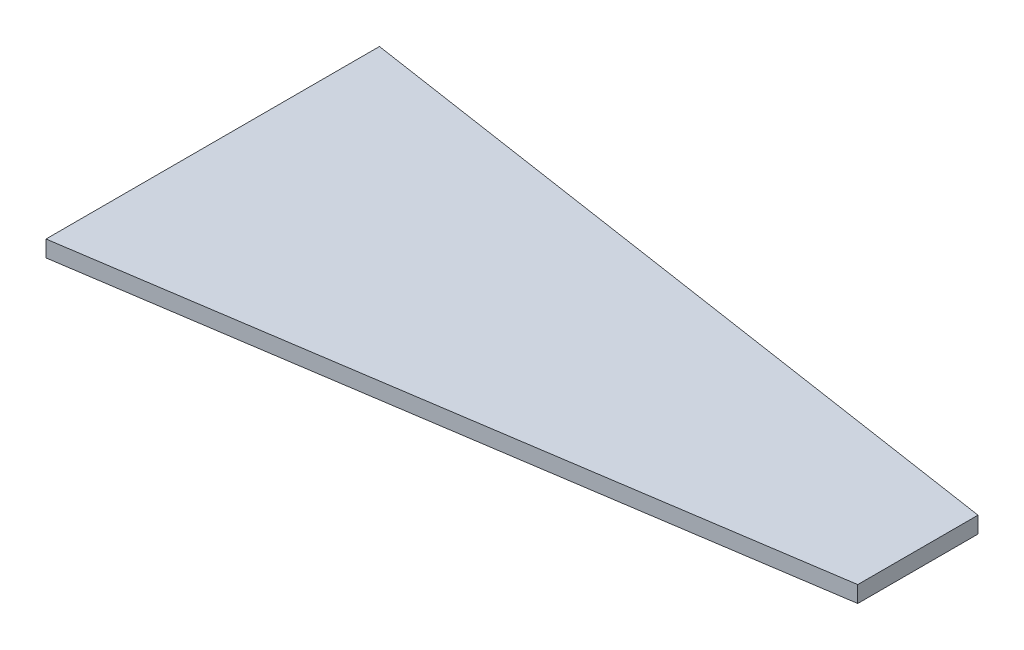
ISO-10303-21;
HEADER;
FILE_DESCRIPTION(('STEP AP214'),'2;1');
FILE_NAME('part.step','',(''),(''),'','','');
FILE_SCHEMA(('AUTOMOTIVE_DESIGN { 1 0 10303 214 1 1 1 1 }'));
ENDSEC;
DATA;
#1=APPLICATION_CONTEXT('core data for automotive mechanical design processes');
#2=APPLICATION_PROTOCOL_DEFINITION('international standard','automotive_design',2000,#1);
#3=PRODUCT_CONTEXT('',#1,'mechanical');
#4=PRODUCT('Part','Part','',(#3));
#5=PRODUCT_RELATED_PRODUCT_CATEGORY('part','',(#4));
#6=PRODUCT_DEFINITION_FORMATION('','',#4);
#7=PRODUCT_DEFINITION_CONTEXT('part definition',#1,'design');
#8=PRODUCT_DEFINITION('design','',#6,#7);
#9=PRODUCT_DEFINITION_SHAPE('','',#8);
#10=(LENGTH_UNIT() NAMED_UNIT(*) SI_UNIT(.MILLI.,.METRE.));
#11=(NAMED_UNIT(*) PLANE_ANGLE_UNIT() SI_UNIT($,.RADIAN.));
#12=(NAMED_UNIT(*) SI_UNIT($,.STERADIAN.) SOLID_ANGLE_UNIT());
#13=UNCERTAINTY_MEASURE_WITH_UNIT(LENGTH_MEASURE(1.E-05),#10,'distance_accuracy_value','');
#14=(GEOMETRIC_REPRESENTATION_CONTEXT(3) GLOBAL_UNCERTAINTY_ASSIGNED_CONTEXT((#13)) GLOBAL_UNIT_ASSIGNED_CONTEXT((#10,
#11,#12)) REPRESENTATION_CONTEXT('',''));
#15=CARTESIAN_POINT('',(0.,0.,0.));
#16=DIRECTION('',(0.,0.,1.));
#17=DIRECTION('',(1.,0.,0.));
#18=AXIS2_PLACEMENT_3D('',#15,#16,#17);
#19=CARTESIAN_POINT('',(0.,3.,30.5));
#20=DIRECTION('',(-0.14946478650778,0.,-0.988767049205314));
#21=DIRECTION('',(-0.988767049205314,0.,0.14946478650778));
#22=AXIS2_PLACEMENT_3D('',#19,#20,#21);
#23=PLANE('',#22);
#24=DIRECTION('',(0.988767049205314,0.,-0.14946478650778));
#25=VECTOR('',#24,1.);
#26=CARTESIAN_POINT('',(0.,0.,30.5));
#27=LINE('',#26,#25);
#28=CARTESIAN_POINT('',(0.,0.,30.5));
#29=VERTEX_POINT('',#28);
#30=CARTESIAN_POINT('',(129.,0.,11.));
#31=VERTEX_POINT('',#30);
#32=EDGE_CURVE('E100',#29,#31,#27,.T.);
#33=ORIENTED_EDGE('',*,*,#32,.T.);
#34=DIRECTION('',(0.,-1.,0.));
#35=VECTOR('',#34,1.);
#36=CARTESIAN_POINT('',(129.,3.,11.));
#37=LINE('',#36,#35);
#38=CARTESIAN_POINT('',(129.,3.,11.));
#39=VERTEX_POINT('',#38);
#40=EDGE_CURVE('E11',#39,#31,#37,.T.);
#41=ORIENTED_EDGE('',*,*,#40,.F.);
#42=DIRECTION('',(0.988767049205314,0.,-0.14946478650778));
#43=VECTOR('',#42,1.);
#44=CARTESIAN_POINT('',(0.,3.,30.5));
#45=LINE('',#44,#43);
#46=CARTESIAN_POINT('',(0.,3.,30.5));
#47=VERTEX_POINT('',#46);
#48=EDGE_CURVE('E88',#47,#39,#45,.T.);
#49=ORIENTED_EDGE('',*,*,#48,.F.);
#50=DIRECTION('',(0.,-1.,0.));
#51=VECTOR('',#50,1.);
#52=CARTESIAN_POINT('',(0.,3.,30.5));
#53=LINE('',#52,#51);
#54=EDGE_CURVE('E96',#47,#29,#53,.T.);
#55=ORIENTED_EDGE('',*,*,#54,.T.);
#56=EDGE_LOOP('',(#33,#41,#49,#55));
#57=FACE_BOUND('',#56,.T.);
#58=ADVANCED_FACE('F37',(#57),#23,.F.);
#59=CARTESIAN_POINT('',(129.,3.,-11.));
#60=DIRECTION('',(-1.,0.,0.));
#61=DIRECTION('',(0.,0.,1.));
#62=AXIS2_PLACEMENT_3D('',#59,#60,#61);
#63=PLANE('',#62);
#64=DIRECTION('',(0.,0.,-1.));
#65=VECTOR('',#64,1.);
#66=CARTESIAN_POINT('',(129.,0.,-11.));
#67=LINE('',#66,#65);
#68=CARTESIAN_POINT('',(129.,0.,-11.));
#69=VERTEX_POINT('',#68);
#70=EDGE_CURVE('E92',#31,#69,#67,.T.);
#71=ORIENTED_EDGE('',*,*,#70,.T.);
#72=DIRECTION('',(0.,-1.,0.));
#73=VECTOR('',#72,1.);
#74=CARTESIAN_POINT('',(129.,3.,-11.));
#75=LINE('',#74,#73);
#76=CARTESIAN_POINT('',(129.,3.,-11.));
#77=VERTEX_POINT('',#76);
#78=EDGE_CURVE('E45',#77,#69,#75,.T.);
#79=ORIENTED_EDGE('',*,*,#78,.F.);
#80=DIRECTION('',(0.,0.,-1.));
#81=VECTOR('',#80,1.);
#82=CARTESIAN_POINT('',(129.,3.,-11.));
#83=LINE('',#82,#81);
#84=EDGE_CURVE('E83',#39,#77,#83,.T.);
#85=ORIENTED_EDGE('',*,*,#84,.F.);
#86=ORIENTED_EDGE('',*,*,#40,.T.);
#87=EDGE_LOOP('',(#71,#79,#85,#86));
#88=FACE_BOUND('',#87,.T.);
#89=ADVANCED_FACE('F91',(#88),#63,.F.);
#90=CARTESIAN_POINT('',(0.,3.,-30.5));
#91=DIRECTION('',(-0.14946478650778,0.,0.988767049205314));
#92=DIRECTION('',(0.988767049205314,0.,0.14946478650778));
#93=AXIS2_PLACEMENT_3D('',#90,#91,#92);
#94=PLANE('',#93);
#95=DIRECTION('',(-0.988767049205314,0.,-0.14946478650778));
#96=VECTOR('',#95,1.);
#97=CARTESIAN_POINT('',(0.,0.,-30.5));
#98=LINE('',#97,#96);
#99=CARTESIAN_POINT('',(0.,0.,-30.5));
#100=VERTEX_POINT('',#99);
#101=EDGE_CURVE('E70',#69,#100,#98,.T.);
#102=ORIENTED_EDGE('',*,*,#101,.T.);
#103=DIRECTION('',(0.,-1.,0.));
#104=VECTOR('',#103,1.);
#105=CARTESIAN_POINT('',(0.,3.,-30.5));
#106=LINE('',#105,#104);
#107=CARTESIAN_POINT('',(0.,3.,-30.5));
#108=VERTEX_POINT('',#107);
#109=EDGE_CURVE('E93',#108,#100,#106,.T.);
#110=ORIENTED_EDGE('',*,*,#109,.F.);
#111=DIRECTION('',(-0.988767049205314,0.,-0.14946478650778));
#112=VECTOR('',#111,1.);
#113=CARTESIAN_POINT('',(0.,3.,-30.5));
#114=LINE('',#113,#112);
#115=EDGE_CURVE('E86',#77,#108,#114,.T.);
#116=ORIENTED_EDGE('',*,*,#115,.F.);
#117=ORIENTED_EDGE('',*,*,#78,.T.);
#118=EDGE_LOOP('',(#102,#110,#116,#117));
#119=FACE_BOUND('',#118,.T.);
#120=ADVANCED_FACE('F94',(#119),#94,.F.);
#121=CARTESIAN_POINT('',(0.,3.,-30.5));
#122=DIRECTION('',(1.,0.,0.));
#123=DIRECTION('',(0.,0.,-1.));
#124=AXIS2_PLACEMENT_3D('',#121,#122,#123);
#125=PLANE('',#124);
#126=DIRECTION('',(0.,0.,1.));
#127=VECTOR('',#126,1.);
#128=CARTESIAN_POINT('',(0.,0.,-30.5));
#129=LINE('',#128,#127);
#130=EDGE_CURVE('E76',#100,#29,#129,.T.);
#131=ORIENTED_EDGE('',*,*,#130,.T.);
#132=ORIENTED_EDGE('',*,*,#54,.F.);
#133=DIRECTION('',(0.,0.,1.));
#134=VECTOR('',#133,1.);
#135=CARTESIAN_POINT('',(0.,3.,-30.5));
#136=LINE('',#135,#134);
#137=EDGE_CURVE('E53',#108,#47,#136,.T.);
#138=ORIENTED_EDGE('',*,*,#137,.F.);
#139=ORIENTED_EDGE('',*,*,#109,.T.);
#140=EDGE_LOOP('',(#131,#132,#138,#139));
#141=FACE_BOUND('',#140,.T.);
#142=ADVANCED_FACE('F107',(#141),#125,.F.);
#143=CARTESIAN_POINT('',(0.,3.,0.));
#144=DIRECTION('',(0.,-1.,0.));
#145=DIRECTION('',(0.,0.,-1.));
#146=AXIS2_PLACEMENT_3D('',#143,#144,#145);
#147=PLANE('',#146);
#148=ORIENTED_EDGE('',*,*,#48,.T.);
#149=ORIENTED_EDGE('',*,*,#84,.T.);
#150=ORIENTED_EDGE('',*,*,#115,.T.);
#151=ORIENTED_EDGE('',*,*,#137,.T.);
#152=EDGE_LOOP('',(#148,#149,#150,#151));
#153=FACE_BOUND('',#152,.T.);
#154=ADVANCED_FACE('F84',(#153),#147,.F.);
#155=CARTESIAN_POINT('',(0.,0.,0.));
#156=DIRECTION('',(0.,-1.,0.));
#157=DIRECTION('',(0.,0.,-1.));
#158=AXIS2_PLACEMENT_3D('',#155,#156,#157);
#159=PLANE('',#158);
#160=ORIENTED_EDGE('',*,*,#32,.F.);
#161=ORIENTED_EDGE('',*,*,#130,.F.);
#162=ORIENTED_EDGE('',*,*,#101,.F.);
#163=ORIENTED_EDGE('',*,*,#70,.F.);
#164=EDGE_LOOP('',(#160,#161,#162,#163));
#165=FACE_BOUND('',#164,.T.);
#166=ADVANCED_FACE('F110',(#165),#159,.T.);
#167=CLOSED_SHELL('',(#58,#89,#120,#142,#154,#166));
#168=MANIFOLD_SOLID_BREP('B2',#167);
#169=ADVANCED_BREP_SHAPE_REPRESENTATION('',(#18,#168),#14);
#170=SHAPE_DEFINITION_REPRESENTATION(#9,#169);
ENDSEC;
END-ISO-10303-21;
